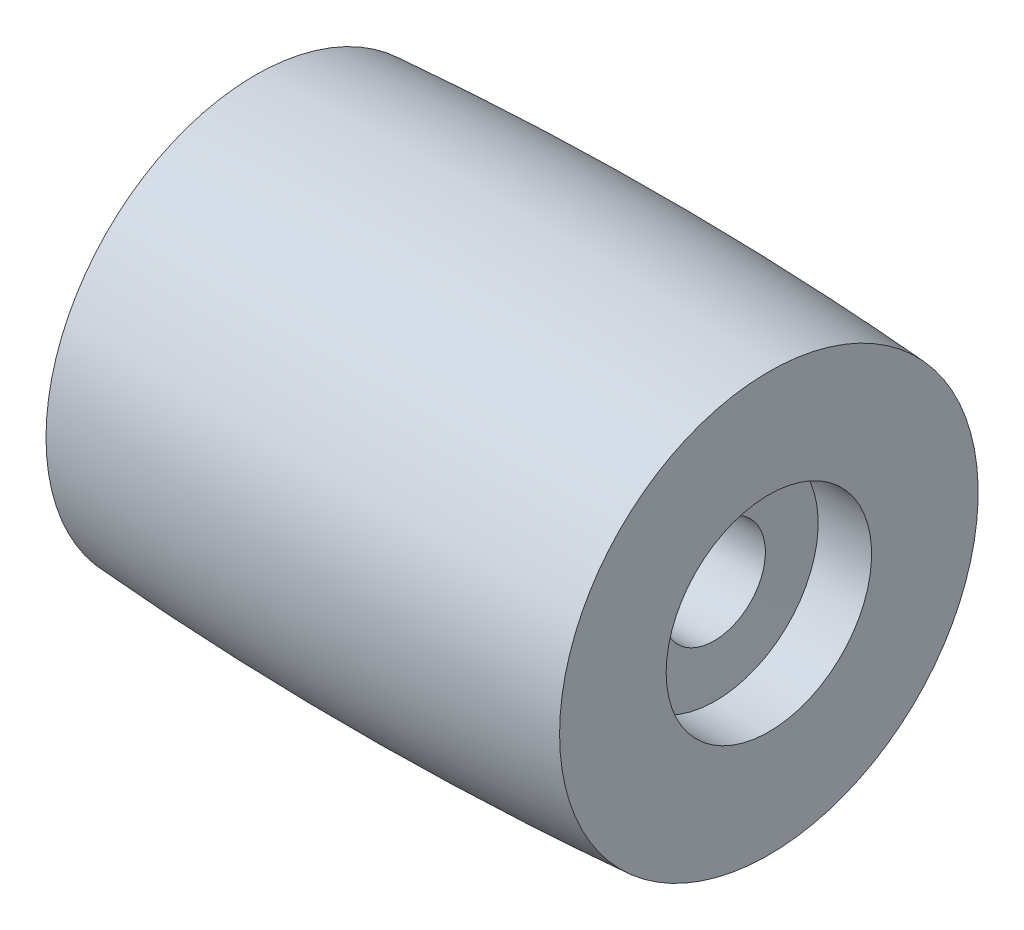
ISO-10303-21;
HEADER;
FILE_DESCRIPTION(('STEP AP214'),'2;1');
FILE_NAME('part.step','',(''),(''),'','','');
FILE_SCHEMA(('AUTOMOTIVE_DESIGN { 1 0 10303 214 1 1 1 1 }'));
ENDSEC;
DATA;
#1=APPLICATION_CONTEXT('core data for automotive mechanical design processes');
#2=APPLICATION_PROTOCOL_DEFINITION('international standard','automotive_design',2000,#1);
#3=PRODUCT_CONTEXT('',#1,'mechanical');
#4=PRODUCT('Part','Part','',(#3));
#5=PRODUCT_RELATED_PRODUCT_CATEGORY('part','',(#4));
#6=PRODUCT_DEFINITION_FORMATION('','',#4);
#7=PRODUCT_DEFINITION_CONTEXT('part definition',#1,'design');
#8=PRODUCT_DEFINITION('design','',#6,#7);
#9=PRODUCT_DEFINITION_SHAPE('','',#8);
#10=(LENGTH_UNIT() NAMED_UNIT(*) SI_UNIT(.MILLI.,.METRE.));
#11=(NAMED_UNIT(*) PLANE_ANGLE_UNIT() SI_UNIT($,.RADIAN.));
#12=(NAMED_UNIT(*) SI_UNIT($,.STERADIAN.) SOLID_ANGLE_UNIT());
#13=UNCERTAINTY_MEASURE_WITH_UNIT(LENGTH_MEASURE(1.E-05),#10,'distance_accuracy_value','');
#14=(GEOMETRIC_REPRESENTATION_CONTEXT(3) GLOBAL_UNCERTAINTY_ASSIGNED_CONTEXT((#13)) GLOBAL_UNIT_ASSIGNED_CONTEXT((#10,
#11,#12)) REPRESENTATION_CONTEXT('',''));
#15=CARTESIAN_POINT('',(0.,0.,0.));
#16=DIRECTION('',(0.,0.,1.));
#17=DIRECTION('',(1.,0.,0.));
#18=AXIS2_PLACEMENT_3D('',#15,#16,#17);
#19=CARTESIAN_POINT('',(10.,0.,0.));
#20=DIRECTION('',(-1.,0.,0.));
#21=DIRECTION('',(0.,0.,1.));
#22=AXIS2_PLACEMENT_3D('',#19,#20,#21);
#23=DEGENERATE_TOROIDAL_SURFACE('',#22,141.516295470958,150.,.F.);
#24=CARTESIAN_POINT('',(0.,0.,0.));
#25=DIRECTION('',(-1.,0.,0.));
#26=DIRECTION('',(0.,0.,1.));
#27=AXIS2_PLACEMENT_3D('',#24,#25,#26);
#28=CIRCLE('',#27,8.15);
#29=CARTESIAN_POINT('',(0.,0.,8.15));
#30=VERTEX_POINT('',#29);
#31=EDGE_CURVE('E72',#30,#30,#28,.T.);
#32=ORIENTED_EDGE('',*,*,#31,.F.);
#33=EDGE_LOOP('',(#32));
#34=FACE_BOUND('',#33,.T.);
#35=CARTESIAN_POINT('',(20.,0.,0.));
#36=DIRECTION('',(-1.,0.,0.));
#37=DIRECTION('',(0.,0.,1.));
#38=AXIS2_PLACEMENT_3D('',#35,#36,#37);
#39=CIRCLE('',#38,8.15);
#40=CARTESIAN_POINT('',(20.,0.,8.15));
#41=VERTEX_POINT('',#40);
#42=EDGE_CURVE('E10',#41,#41,#39,.T.);
#43=ORIENTED_EDGE('',*,*,#42,.T.);
#44=EDGE_LOOP('',(#43));
#45=FACE_BOUND('',#44,.T.);
#46=ADVANCED_FACE('F37',(#34,#45),#23,.F.);
#47=CARTESIAN_POINT('',(20.,4.,0.));
#48=DIRECTION('',(-1.,0.,0.));
#49=DIRECTION('',(0.,0.,1.));
#50=AXIS2_PLACEMENT_3D('',#47,#48,#49);
#51=PLANE('',#50);
#52=ORIENTED_EDGE('',*,*,#42,.F.);
#53=EDGE_LOOP('',(#52));
#54=FACE_BOUND('',#53,.T.);
#55=CARTESIAN_POINT('',(20.,0.,0.));
#56=DIRECTION('',(-1.,0.,0.));
#57=DIRECTION('',(0.,0.,1.));
#58=AXIS2_PLACEMENT_3D('',#55,#56,#57);
#59=CIRCLE('',#58,4.);
#60=CARTESIAN_POINT('',(20.,0.,4.));
#61=VERTEX_POINT('',#60);
#62=EDGE_CURVE('E44',#61,#61,#59,.T.);
#63=ORIENTED_EDGE('',*,*,#62,.T.);
#64=EDGE_LOOP('',(#63));
#65=FACE_BOUND('',#64,.T.);
#66=ADVANCED_FACE('F80',(#54,#65),#51,.F.);
#67=CARTESIAN_POINT('',(0.,0.,0.));
#68=DIRECTION('',(-1.,0.,0.));
#69=DIRECTION('',(0.,0.,1.));
#70=AXIS2_PLACEMENT_3D('',#67,#68,#69);
#71=CYLINDRICAL_SURFACE('',#70,4.);
#72=ORIENTED_EDGE('',*,*,#62,.F.);
#73=EDGE_LOOP('',(#72));
#74=FACE_BOUND('',#73,.T.);
#75=CARTESIAN_POINT('',(17.9189189189189,0.,0.));
#76=DIRECTION('',(-1.,0.,0.));
#77=DIRECTION('',(0.,0.,1.));
#78=AXIS2_PLACEMENT_3D('',#75,#76,#77);
#79=CIRCLE('',#78,4.);
#80=CARTESIAN_POINT('',(17.9189189189189,0.,4.));
#81=VERTEX_POINT('',#80);
#82=EDGE_CURVE('E49',#81,#81,#79,.T.);
#83=ORIENTED_EDGE('',*,*,#82,.T.);
#84=EDGE_LOOP('',(#83));
#85=FACE_BOUND('',#84,.T.);
#86=ADVANCED_FACE('F84',(#74,#85),#71,.F.);
#87=CARTESIAN_POINT('',(17.8648648648649,0.,0.));
#88=DIRECTION('',(1.,0.,0.));
#89=DIRECTION('',(0.,0.,-1.));
#90=AXIS2_PLACEMENT_3D('',#87,#88,#89);
#91=CONICAL_SURFACE('',#90,2.,1.54377587760763);
#92=ORIENTED_EDGE('',*,*,#82,.F.);
#93=EDGE_LOOP('',(#92));
#94=FACE_BOUND('',#93,.T.);
#95=CARTESIAN_POINT('',(17.8648648648649,0.,0.));
#96=DIRECTION('',(-1.,0.,0.));
#97=DIRECTION('',(0.,0.,1.));
#98=AXIS2_PLACEMENT_3D('',#95,#96,#97);
#99=CIRCLE('',#98,2.);
#100=CARTESIAN_POINT('',(17.8648648648649,0.,2.));
#101=VERTEX_POINT('',#100);
#102=EDGE_CURVE('E54',#101,#101,#99,.T.);
#103=ORIENTED_EDGE('',*,*,#102,.T.);
#104=EDGE_LOOP('',(#103));
#105=FACE_BOUND('',#104,.T.);
#106=ADVANCED_FACE('F89',(#94,#105),#91,.F.);
#107=CARTESIAN_POINT('',(0.,0.,0.));
#108=DIRECTION('',(-1.,0.,0.));
#109=DIRECTION('',(0.,0.,1.));
#110=AXIS2_PLACEMENT_3D('',#107,#108,#109);
#111=CYLINDRICAL_SURFACE('',#110,2.);
#112=ORIENTED_EDGE('',*,*,#102,.F.);
#113=EDGE_LOOP('',(#112));
#114=FACE_BOUND('',#113,.T.);
#115=CARTESIAN_POINT('',(2.08108108108108,0.,0.));
#116=DIRECTION('',(-1.,0.,0.));
#117=DIRECTION('',(0.,0.,1.));
#118=AXIS2_PLACEMENT_3D('',#115,#116,#117);
#119=CIRCLE('',#118,2.);
#120=CARTESIAN_POINT('',(2.08108108108108,0.,2.));
#121=VERTEX_POINT('',#120);
#122=EDGE_CURVE('E60',#121,#121,#119,.T.);
#123=ORIENTED_EDGE('',*,*,#122,.T.);
#124=EDGE_LOOP('',(#123));
#125=FACE_BOUND('',#124,.T.);
#126=ADVANCED_FACE('F95',(#114,#125),#111,.F.);
#127=CARTESIAN_POINT('',(2.08108108108108,4.,0.));
#128=DIRECTION('',(1.,0.,0.));
#129=DIRECTION('',(0.,0.,-1.));
#130=AXIS2_PLACEMENT_3D('',#127,#128,#129);
#131=PLANE('',#130);
#132=ORIENTED_EDGE('',*,*,#122,.F.);
#133=EDGE_LOOP('',(#132));
#134=FACE_BOUND('',#133,.T.);
#135=CARTESIAN_POINT('',(2.08108108108108,0.,0.));
#136=DIRECTION('',(-1.,0.,0.));
#137=DIRECTION('',(0.,0.,1.));
#138=AXIS2_PLACEMENT_3D('',#135,#136,#137);
#139=CIRCLE('',#138,4.);
#140=CARTESIAN_POINT('',(2.08108108108108,0.,4.));
#141=VERTEX_POINT('',#140);
#142=EDGE_CURVE('E64',#141,#141,#139,.T.);
#143=ORIENTED_EDGE('',*,*,#142,.T.);
#144=EDGE_LOOP('',(#143));
#145=FACE_BOUND('',#144,.T.);
#146=ADVANCED_FACE('F99',(#134,#145),#131,.F.);
#147=CARTESIAN_POINT('',(0.,0.,0.));
#148=DIRECTION('',(-1.,0.,0.));
#149=DIRECTION('',(0.,0.,1.));
#150=AXIS2_PLACEMENT_3D('',#147,#148,#149);
#151=CYLINDRICAL_SURFACE('',#150,4.);
#152=ORIENTED_EDGE('',*,*,#142,.F.);
#153=EDGE_LOOP('',(#152));
#154=FACE_BOUND('',#153,.T.);
#155=CARTESIAN_POINT('',(0.,0.,0.));
#156=DIRECTION('',(-1.,0.,0.));
#157=DIRECTION('',(0.,0.,1.));
#158=AXIS2_PLACEMENT_3D('',#155,#156,#157);
#159=CIRCLE('',#158,4.);
#160=CARTESIAN_POINT('',(0.,0.,4.));
#161=VERTEX_POINT('',#160);
#162=EDGE_CURVE('E68',#161,#161,#159,.T.);
#163=ORIENTED_EDGE('',*,*,#162,.T.);
#164=EDGE_LOOP('',(#163));
#165=FACE_BOUND('',#164,.T.);
#166=ADVANCED_FACE('F103',(#154,#165),#151,.F.);
#167=CARTESIAN_POINT('',(0.,8.15,0.));
#168=DIRECTION('',(1.,0.,0.));
#169=DIRECTION('',(0.,0.,-1.));
#170=AXIS2_PLACEMENT_3D('',#167,#168,#169);
#171=PLANE('',#170);
#172=ORIENTED_EDGE('',*,*,#162,.F.);
#173=EDGE_LOOP('',(#172));
#174=FACE_BOUND('',#173,.T.);
#175=ORIENTED_EDGE('',*,*,#31,.T.);
#176=EDGE_LOOP('',(#175));
#177=FACE_BOUND('',#176,.T.);
#178=ADVANCED_FACE('F77',(#174,#177),#171,.F.);
#179=CLOSED_SHELL('',(#46,#66,#86,#106,#126,#146,#166,#178));
#180=MANIFOLD_SOLID_BREP('B2',#179);
#181=ADVANCED_BREP_SHAPE_REPRESENTATION('',(#18,#180),#14);
#182=SHAPE_DEFINITION_REPRESENTATION(#9,#181);
ENDSEC;
END-ISO-10303-21;
